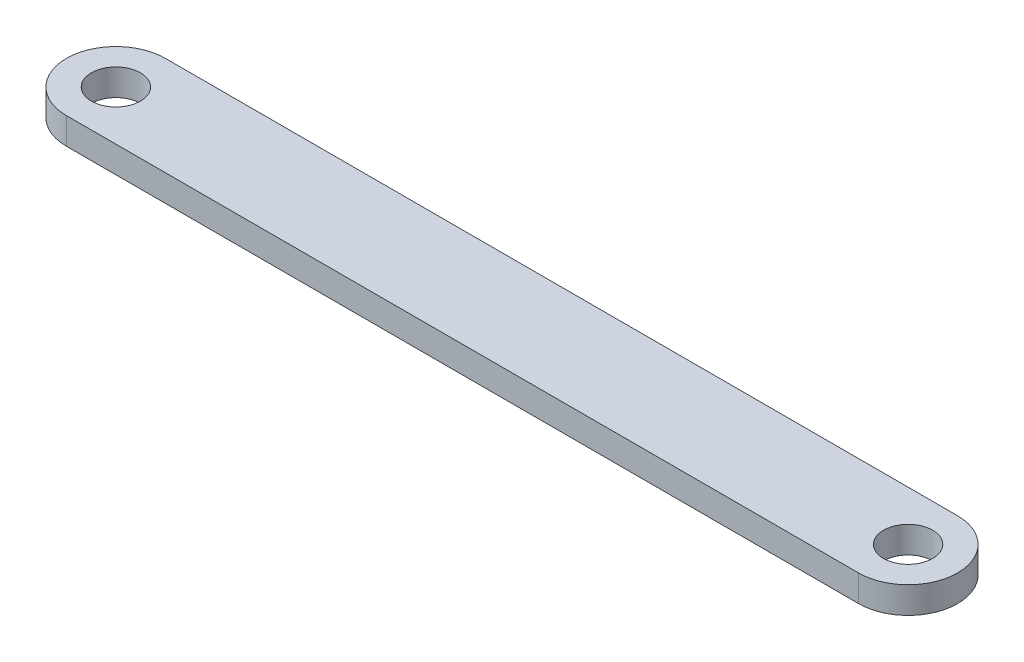
ISO-10303-21;
HEADER;
FILE_DESCRIPTION(('STEP AP214'),'2;1');
FILE_NAME('part.step','',(''),(''),'','','');
FILE_SCHEMA(('AUTOMOTIVE_DESIGN { 1 0 10303 214 1 1 1 1 }'));
ENDSEC;
DATA;
#1=APPLICATION_CONTEXT('core data for automotive mechanical design processes');
#2=APPLICATION_PROTOCOL_DEFINITION('international standard','automotive_design',2000,#1);
#3=PRODUCT_CONTEXT('',#1,'mechanical');
#4=PRODUCT('Part','Part','',(#3));
#5=PRODUCT_RELATED_PRODUCT_CATEGORY('part','',(#4));
#6=PRODUCT_DEFINITION_FORMATION('','',#4);
#7=PRODUCT_DEFINITION_CONTEXT('part definition',#1,'design');
#8=PRODUCT_DEFINITION('design','',#6,#7);
#9=PRODUCT_DEFINITION_SHAPE('','',#8);
#10=(LENGTH_UNIT() NAMED_UNIT(*) SI_UNIT(.MILLI.,.METRE.));
#11=(NAMED_UNIT(*) PLANE_ANGLE_UNIT() SI_UNIT($,.RADIAN.));
#12=(NAMED_UNIT(*) SI_UNIT($,.STERADIAN.) SOLID_ANGLE_UNIT());
#13=UNCERTAINTY_MEASURE_WITH_UNIT(LENGTH_MEASURE(1.E-05),#10,'distance_accuracy_value','');
#14=(GEOMETRIC_REPRESENTATION_CONTEXT(3) GLOBAL_UNCERTAINTY_ASSIGNED_CONTEXT((#13)) GLOBAL_UNIT_ASSIGNED_CONTEXT((#10,
#11,#12)) REPRESENTATION_CONTEXT('',''));
#15=CARTESIAN_POINT('',(0.,0.,0.));
#16=DIRECTION('',(0.,0.,1.));
#17=DIRECTION('',(1.,0.,0.));
#18=AXIS2_PLACEMENT_3D('',#15,#16,#17);
#19=CARTESIAN_POINT('',(0.,6.5,0.));
#20=DIRECTION('',(0.,1.,0.));
#21=DIRECTION('',(0.,0.,1.));
#22=AXIS2_PLACEMENT_3D('',#19,#20,#21);
#23=PLANE('',#22);
#24=CARTESIAN_POINT('',(193.705275083214,6.5,0.));
#25=DIRECTION('',(0.,1.,0.));
#26=DIRECTION('',(0.,0.,1.));
#27=AXIS2_PLACEMENT_3D('',#24,#25,#26);
#28=CIRCLE('',#27,6.00000000000002);
#29=CARTESIAN_POINT('',(193.705275083214,6.5,6.00000000000002));
#30=VERTEX_POINT('',#29);
#31=EDGE_CURVE('E128',#30,#30,#28,.T.);
#32=ORIENTED_EDGE('',*,*,#31,.F.);
#33=EDGE_LOOP('',(#32));
#34=FACE_BOUND('',#33,.T.);
#35=CARTESIAN_POINT('',(0.,6.5,0.));
#36=DIRECTION('',(0.,1.,0.));
#37=DIRECTION('',(0.,0.,1.));
#38=AXIS2_PLACEMENT_3D('',#35,#36,#37);
#39=CIRCLE('',#38,12.1065796927009);
#40=CARTESIAN_POINT('',(0.,6.5,-12.1065796927009));
#41=VERTEX_POINT('',#40);
#42=CARTESIAN_POINT('',(0.,6.5,12.1065796927009));
#43=VERTEX_POINT('',#42);
#44=EDGE_CURVE('E112',#41,#43,#39,.T.);
#45=ORIENTED_EDGE('',*,*,#44,.T.);
#46=DIRECTION('',(1.,0.,0.));
#47=VECTOR('',#46,1.);
#48=CARTESIAN_POINT('',(0.,6.5,12.1065796927009));
#49=LINE('',#48,#47);
#50=CARTESIAN_POINT('',(193.705275083214,6.5,12.1065796927009));
#51=VERTEX_POINT('',#50);
#52=EDGE_CURVE('E105',#43,#51,#49,.T.);
#53=ORIENTED_EDGE('',*,*,#52,.T.);
#54=CARTESIAN_POINT('',(193.705275083214,6.5,0.));
#55=DIRECTION('',(0.,1.,0.));
#56=DIRECTION('',(0.,0.,1.));
#57=AXIS2_PLACEMENT_3D('',#54,#55,#56);
#58=CIRCLE('',#57,12.1065796927009);
#59=CARTESIAN_POINT('',(193.705275083214,6.5,-12.1065796927009));
#60=VERTEX_POINT('',#59);
#61=EDGE_CURVE('E111',#51,#60,#58,.T.);
#62=ORIENTED_EDGE('',*,*,#61,.T.);
#63=DIRECTION('',(1.,0.,0.));
#64=VECTOR('',#63,1.);
#65=CARTESIAN_POINT('',(0.,6.5,-12.1065796927009));
#66=LINE('',#65,#64);
#67=EDGE_CURVE('E121',#41,#60,#66,.T.);
#68=ORIENTED_EDGE('',*,*,#67,.F.);
#69=EDGE_LOOP('',(#45,#53,#62,#68));
#70=FACE_BOUND('',#69,.T.);
#71=CARTESIAN_POINT('',(0.,6.5,0.));
#72=DIRECTION('',(0.,1.,0.));
#73=DIRECTION('',(0.,0.,1.));
#74=AXIS2_PLACEMENT_3D('',#71,#72,#73);
#75=CIRCLE('',#74,6.);
#76=CARTESIAN_POINT('',(0.,6.5,6.));
#77=VERTEX_POINT('',#76);
#78=EDGE_CURVE('E141',#77,#77,#75,.T.);
#79=ORIENTED_EDGE('',*,*,#78,.F.);
#80=EDGE_LOOP('',(#79));
#81=FACE_BOUND('',#80,.T.);
#82=ADVANCED_FACE('F62',(#34,#70,#81),#23,.T.);
#83=CARTESIAN_POINT('',(0.,0.,0.));
#84=DIRECTION('',(0.,1.,0.));
#85=DIRECTION('',(0.,0.,1.));
#86=AXIS2_PLACEMENT_3D('',#83,#84,#85);
#87=PLANE('',#86);
#88=CARTESIAN_POINT('',(193.705275083214,0.,0.));
#89=DIRECTION('',(0.,1.,0.));
#90=DIRECTION('',(0.,0.,1.));
#91=AXIS2_PLACEMENT_3D('',#88,#89,#90);
#92=CIRCLE('',#91,6.00000000000002);
#93=CARTESIAN_POINT('',(193.705275083214,0.,6.00000000000002));
#94=VERTEX_POINT('',#93);
#95=EDGE_CURVE('E138',#94,#94,#92,.T.);
#96=ORIENTED_EDGE('',*,*,#95,.T.);
#97=EDGE_LOOP('',(#96));
#98=FACE_BOUND('',#97,.T.);
#99=CARTESIAN_POINT('',(0.,0.,0.));
#100=DIRECTION('',(0.,1.,0.));
#101=DIRECTION('',(0.,0.,1.));
#102=AXIS2_PLACEMENT_3D('',#99,#100,#101);
#103=CIRCLE('',#102,12.1065796927009);
#104=CARTESIAN_POINT('',(0.,0.,-12.1065796927009));
#105=VERTEX_POINT('',#104);
#106=CARTESIAN_POINT('',(0.,0.,12.1065796927009));
#107=VERTEX_POINT('',#106);
#108=EDGE_CURVE('E126',#105,#107,#103,.T.);
#109=ORIENTED_EDGE('',*,*,#108,.F.);
#110=DIRECTION('',(1.,0.,0.));
#111=VECTOR('',#110,1.);
#112=CARTESIAN_POINT('',(0.,0.,-12.1065796927009));
#113=LINE('',#112,#111);
#114=CARTESIAN_POINT('',(193.705275083214,0.,-12.1065796927009));
#115=VERTEX_POINT('',#114);
#116=EDGE_CURVE('E132',#105,#115,#113,.T.);
#117=ORIENTED_EDGE('',*,*,#116,.T.);
#118=CARTESIAN_POINT('',(193.705275083214,0.,0.));
#119=DIRECTION('',(0.,1.,0.));
#120=DIRECTION('',(0.,0.,1.));
#121=AXIS2_PLACEMENT_3D('',#118,#119,#120);
#122=CIRCLE('',#121,12.1065796927009);
#123=CARTESIAN_POINT('',(193.705275083214,0.,12.1065796927009));
#124=VERTEX_POINT('',#123);
#125=EDGE_CURVE('E130',#124,#115,#122,.T.);
#126=ORIENTED_EDGE('',*,*,#125,.F.);
#127=DIRECTION('',(1.,0.,0.));
#128=VECTOR('',#127,1.);
#129=CARTESIAN_POINT('',(0.,0.,12.1065796927009));
#130=LINE('',#129,#128);
#131=EDGE_CURVE('E117',#107,#124,#130,.T.);
#132=ORIENTED_EDGE('',*,*,#131,.F.);
#133=EDGE_LOOP('',(#109,#117,#126,#132));
#134=FACE_BOUND('',#133,.T.);
#135=CARTESIAN_POINT('',(0.,0.,0.));
#136=DIRECTION('',(0.,1.,0.));
#137=DIRECTION('',(0.,0.,1.));
#138=AXIS2_PLACEMENT_3D('',#135,#136,#137);
#139=CIRCLE('',#138,6.);
#140=CARTESIAN_POINT('',(0.,0.,6.));
#141=VERTEX_POINT('',#140);
#142=EDGE_CURVE('E144',#141,#141,#139,.T.);
#143=ORIENTED_EDGE('',*,*,#142,.T.);
#144=EDGE_LOOP('',(#143));
#145=FACE_BOUND('',#144,.T.);
#146=ADVANCED_FACE('F153',(#98,#134,#145),#87,.F.);
#147=CARTESIAN_POINT('',(0.,6.5,0.));
#148=DIRECTION('',(0.,-1.,0.));
#149=DIRECTION('',(0.,0.,-1.));
#150=AXIS2_PLACEMENT_3D('',#147,#148,#149);
#151=CYLINDRICAL_SURFACE('',#150,12.1065796927009);
#152=ORIENTED_EDGE('',*,*,#108,.T.);
#153=DIRECTION('',(0.,-1.,0.));
#154=VECTOR('',#153,1.);
#155=CARTESIAN_POINT('',(0.,6.5,12.1065796927009));
#156=LINE('',#155,#154);
#157=EDGE_CURVE('E12',#43,#107,#156,.T.);
#158=ORIENTED_EDGE('',*,*,#157,.F.);
#159=ORIENTED_EDGE('',*,*,#44,.F.);
#160=DIRECTION('',(0.,-1.,0.));
#161=VECTOR('',#160,1.);
#162=CARTESIAN_POINT('',(0.,6.5,-12.1065796927009));
#163=LINE('',#162,#161);
#164=EDGE_CURVE('E79',#41,#105,#163,.T.);
#165=ORIENTED_EDGE('',*,*,#164,.T.);
#166=EDGE_LOOP('',(#152,#158,#159,#165));
#167=FACE_BOUND('',#166,.T.);
#168=ADVANCED_FACE('F64',(#167),#151,.T.);
#169=CARTESIAN_POINT('',(0.,6.5,12.1065796927009));
#170=DIRECTION('',(0.,0.,-1.));
#171=DIRECTION('',(-1.,0.,0.));
#172=AXIS2_PLACEMENT_3D('',#169,#170,#171);
#173=PLANE('',#172);
#174=ORIENTED_EDGE('',*,*,#131,.T.);
#175=DIRECTION('',(0.,-1.,0.));
#176=VECTOR('',#175,1.);
#177=CARTESIAN_POINT('',(193.705275083214,6.5,12.1065796927009));
#178=LINE('',#177,#176);
#179=EDGE_CURVE('E71',#51,#124,#178,.T.);
#180=ORIENTED_EDGE('',*,*,#179,.F.);
#181=ORIENTED_EDGE('',*,*,#52,.F.);
#182=ORIENTED_EDGE('',*,*,#157,.T.);
#183=EDGE_LOOP('',(#174,#180,#181,#182));
#184=FACE_BOUND('',#183,.T.);
#185=ADVANCED_FACE('F116',(#184),#173,.F.);
#186=CARTESIAN_POINT('',(193.705275083214,6.5,0.));
#187=DIRECTION('',(0.,-1.,0.));
#188=DIRECTION('',(0.,0.,-1.));
#189=AXIS2_PLACEMENT_3D('',#186,#187,#188);
#190=CYLINDRICAL_SURFACE('',#189,12.1065796927009);
#191=ORIENTED_EDGE('',*,*,#125,.T.);
#192=DIRECTION('',(0.,-1.,0.));
#193=VECTOR('',#192,1.);
#194=CARTESIAN_POINT('',(193.705275083214,6.5,-12.1065796927009));
#195=LINE('',#194,#193);
#196=EDGE_CURVE('E94',#60,#115,#195,.T.);
#197=ORIENTED_EDGE('',*,*,#196,.F.);
#198=ORIENTED_EDGE('',*,*,#61,.F.);
#199=ORIENTED_EDGE('',*,*,#179,.T.);
#200=EDGE_LOOP('',(#191,#197,#198,#199));
#201=FACE_BOUND('',#200,.T.);
#202=ADVANCED_FACE('F120',(#201),#190,.T.);
#203=CARTESIAN_POINT('',(0.,6.5,-12.1065796927009));
#204=DIRECTION('',(0.,0.,-1.));
#205=DIRECTION('',(-1.,0.,0.));
#206=AXIS2_PLACEMENT_3D('',#203,#204,#205);
#207=PLANE('',#206);
#208=ORIENTED_EDGE('',*,*,#116,.F.);
#209=ORIENTED_EDGE('',*,*,#164,.F.);
#210=ORIENTED_EDGE('',*,*,#67,.T.);
#211=ORIENTED_EDGE('',*,*,#196,.T.);
#212=EDGE_LOOP('',(#208,#209,#210,#211));
#213=FACE_BOUND('',#212,.T.);
#214=ADVANCED_FACE('F166',(#213),#207,.T.);
#215=CARTESIAN_POINT('',(193.705275083214,6.5,0.));
#216=DIRECTION('',(0.,-1.,0.));
#217=DIRECTION('',(0.,0.,-1.));
#218=AXIS2_PLACEMENT_3D('',#215,#216,#217);
#219=CYLINDRICAL_SURFACE('',#218,6.00000000000002);
#220=ORIENTED_EDGE('',*,*,#31,.T.);
#221=EDGE_LOOP('',(#220));
#222=FACE_BOUND('',#221,.T.);
#223=ORIENTED_EDGE('',*,*,#95,.F.);
#224=EDGE_LOOP('',(#223));
#225=FACE_BOUND('',#224,.T.);
#226=ADVANCED_FACE('F163',(#222,#225),#219,.F.);
#227=CARTESIAN_POINT('',(0.,6.5,0.));
#228=DIRECTION('',(0.,-1.,0.));
#229=DIRECTION('',(0.,0.,-1.));
#230=AXIS2_PLACEMENT_3D('',#227,#228,#229);
#231=CYLINDRICAL_SURFACE('',#230,6.);
#232=ORIENTED_EDGE('',*,*,#78,.T.);
#233=EDGE_LOOP('',(#232));
#234=FACE_BOUND('',#233,.T.);
#235=ORIENTED_EDGE('',*,*,#142,.F.);
#236=EDGE_LOOP('',(#235));
#237=FACE_BOUND('',#236,.T.);
#238=ADVANCED_FACE('F150',(#234,#237),#231,.F.);
#239=CLOSED_SHELL('',(#82,#146,#168,#185,#202,#214,#226,#238));
#240=MANIFOLD_SOLID_BREP('B2',#239);
#241=ADVANCED_BREP_SHAPE_REPRESENTATION('',(#18,#240),#14);
#242=SHAPE_DEFINITION_REPRESENTATION(#9,#241);
ENDSEC;
END-ISO-10303-21;
